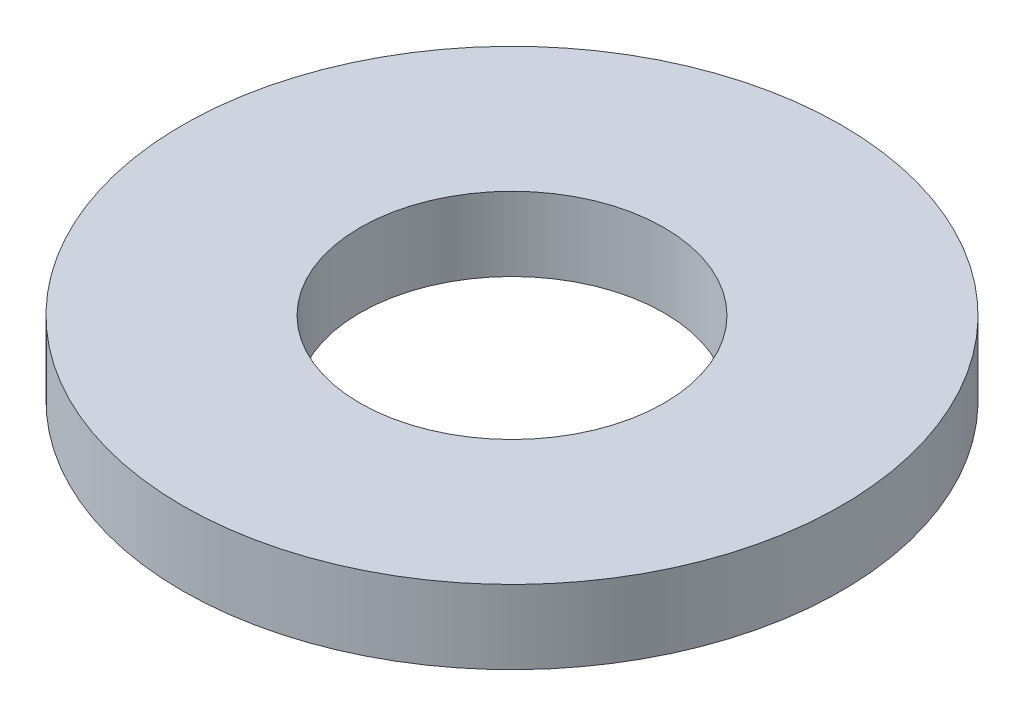
ISO-10303-21;
HEADER;
FILE_DESCRIPTION(('STEP AP214'),'2;1');
FILE_NAME('part.step','',(''),(''),'','','');
FILE_SCHEMA(('AUTOMOTIVE_DESIGN { 1 0 10303 214 1 1 1 1 }'));
ENDSEC;
DATA;
#1=APPLICATION_CONTEXT('core data for automotive mechanical design processes');
#2=APPLICATION_PROTOCOL_DEFINITION('international standard','automotive_design',2000,#1);
#3=PRODUCT_CONTEXT('',#1,'mechanical');
#4=PRODUCT('Part','Part','',(#3));
#5=PRODUCT_RELATED_PRODUCT_CATEGORY('part','',(#4));
#6=PRODUCT_DEFINITION_FORMATION('','',#4);
#7=PRODUCT_DEFINITION_CONTEXT('part definition',#1,'design');
#8=PRODUCT_DEFINITION('design','',#6,#7);
#9=PRODUCT_DEFINITION_SHAPE('','',#8);
#10=(LENGTH_UNIT() NAMED_UNIT(*) SI_UNIT(.MILLI.,.METRE.));
#11=(NAMED_UNIT(*) PLANE_ANGLE_UNIT() SI_UNIT($,.RADIAN.));
#12=(NAMED_UNIT(*) SI_UNIT($,.STERADIAN.) SOLID_ANGLE_UNIT());
#13=UNCERTAINTY_MEASURE_WITH_UNIT(LENGTH_MEASURE(1.E-05),#10,'distance_accuracy_value','');
#14=(GEOMETRIC_REPRESENTATION_CONTEXT(3) GLOBAL_UNCERTAINTY_ASSIGNED_CONTEXT((#13)) GLOBAL_UNIT_ASSIGNED_CONTEXT((#10,
#11,#12)) REPRESENTATION_CONTEXT('',''));
#15=CARTESIAN_POINT('',(0.,0.,0.));
#16=DIRECTION('',(0.,0.,1.));
#17=DIRECTION('',(1.,0.,0.));
#18=AXIS2_PLACEMENT_3D('',#15,#16,#17);
#19=CARTESIAN_POINT('',(0.,0.,0.));
#20=DIRECTION('',(0.,1.,0.));
#21=DIRECTION('',(0.,0.,1.));
#22=AXIS2_PLACEMENT_3D('',#19,#20,#21);
#23=PLANE('',#22);
#24=CARTESIAN_POINT('',(0.,0.,0.));
#25=DIRECTION('',(0.,-1.,0.));
#26=DIRECTION('',(0.,0.,-1.));
#27=AXIS2_PLACEMENT_3D('',#24,#25,#26);
#28=CIRCLE('',#27,2.1971);
#29=CARTESIAN_POINT('',(0.,0.,-2.1971));
#30=VERTEX_POINT('',#29);
#31=EDGE_CURVE('E26',#30,#30,#28,.F.);
#32=ORIENTED_EDGE('',*,*,#31,.T.);
#33=EDGE_LOOP('',(#32));
#34=FACE_BOUND('',#33,.T.);
#35=CARTESIAN_POINT('',(0.,0.,0.));
#36=DIRECTION('',(0.,-1.,0.));
#37=DIRECTION('',(0.,0.,-1.));
#38=AXIS2_PLACEMENT_3D('',#35,#36,#37);
#39=CIRCLE('',#38,4.7625);
#40=CARTESIAN_POINT('',(0.,0.,-4.7625));
#41=VERTEX_POINT('',#40);
#42=EDGE_CURVE('E17',#41,#41,#39,.F.);
#43=ORIENTED_EDGE('',*,*,#42,.F.);
#44=EDGE_LOOP('',(#43));
#45=FACE_BOUND('',#44,.T.);
#46=ADVANCED_FACE('F14',(#34,#45),#23,.F.);
#47=CARTESIAN_POINT('',(0.,1.0668,0.));
#48=DIRECTION('',(0.,-1.,0.));
#49=DIRECTION('',(0.,0.,-1.));
#50=AXIS2_PLACEMENT_3D('',#47,#48,#49);
#51=CYLINDRICAL_SURFACE('',#50,4.7625);
#52=ORIENTED_EDGE('',*,*,#42,.T.);
#53=EDGE_LOOP('',(#52));
#54=FACE_BOUND('',#53,.T.);
#55=CARTESIAN_POINT('',(0.,1.0668,0.));
#56=DIRECTION('',(0.,-1.,0.));
#57=DIRECTION('',(0.,0.,-1.));
#58=AXIS2_PLACEMENT_3D('',#55,#56,#57);
#59=CIRCLE('',#58,4.7625);
#60=CARTESIAN_POINT('',(0.,1.0668,-4.7625));
#61=VERTEX_POINT('',#60);
#62=EDGE_CURVE('E21',#61,#61,#59,.F.);
#63=ORIENTED_EDGE('',*,*,#62,.F.);
#64=EDGE_LOOP('',(#63));
#65=FACE_BOUND('',#64,.T.);
#66=ADVANCED_FACE('F34',(#54,#65),#51,.T.);
#67=CARTESIAN_POINT('',(0.,1.0668,0.));
#68=DIRECTION('',(0.,-1.,0.));
#69=DIRECTION('',(0.,0.,-1.));
#70=AXIS2_PLACEMENT_3D('',#67,#68,#69);
#71=CYLINDRICAL_SURFACE('',#70,2.1971);
#72=CARTESIAN_POINT('',(0.,1.0668,0.));
#73=DIRECTION('',(0.,-1.,0.));
#74=DIRECTION('',(0.,0.,-1.));
#75=AXIS2_PLACEMENT_3D('',#72,#73,#74);
#76=CIRCLE('',#75,2.1971);
#77=CARTESIAN_POINT('',(0.,1.0668,-2.1971));
#78=VERTEX_POINT('',#77);
#79=EDGE_CURVE('E9',#78,#78,#76,.T.);
#80=ORIENTED_EDGE('',*,*,#79,.F.);
#81=EDGE_LOOP('',(#80));
#82=FACE_BOUND('',#81,.T.);
#83=ORIENTED_EDGE('',*,*,#31,.F.);
#84=EDGE_LOOP('',(#83));
#85=FACE_BOUND('',#84,.T.);
#86=ADVANCED_FACE('F42',(#82,#85),#71,.F.);
#87=CARTESIAN_POINT('',(0.,1.0668,0.));
#88=DIRECTION('',(0.,1.,0.));
#89=DIRECTION('',(0.,0.,1.));
#90=AXIS2_PLACEMENT_3D('',#87,#88,#89);
#91=PLANE('',#90);
#92=ORIENTED_EDGE('',*,*,#79,.T.);
#93=EDGE_LOOP('',(#92));
#94=FACE_BOUND('',#93,.T.);
#95=ORIENTED_EDGE('',*,*,#62,.T.);
#96=EDGE_LOOP('',(#95));
#97=FACE_BOUND('',#96,.T.);
#98=ADVANCED_FACE('F43',(#94,#97),#91,.T.);
#99=CLOSED_SHELL('',(#46,#66,#86,#98));
#100=MANIFOLD_SOLID_BREP('B1',#99);
#101=ADVANCED_BREP_SHAPE_REPRESENTATION('',(#18,#100),#14);
#102=SHAPE_DEFINITION_REPRESENTATION(#9,#101);
ENDSEC;
END-ISO-10303-21;
